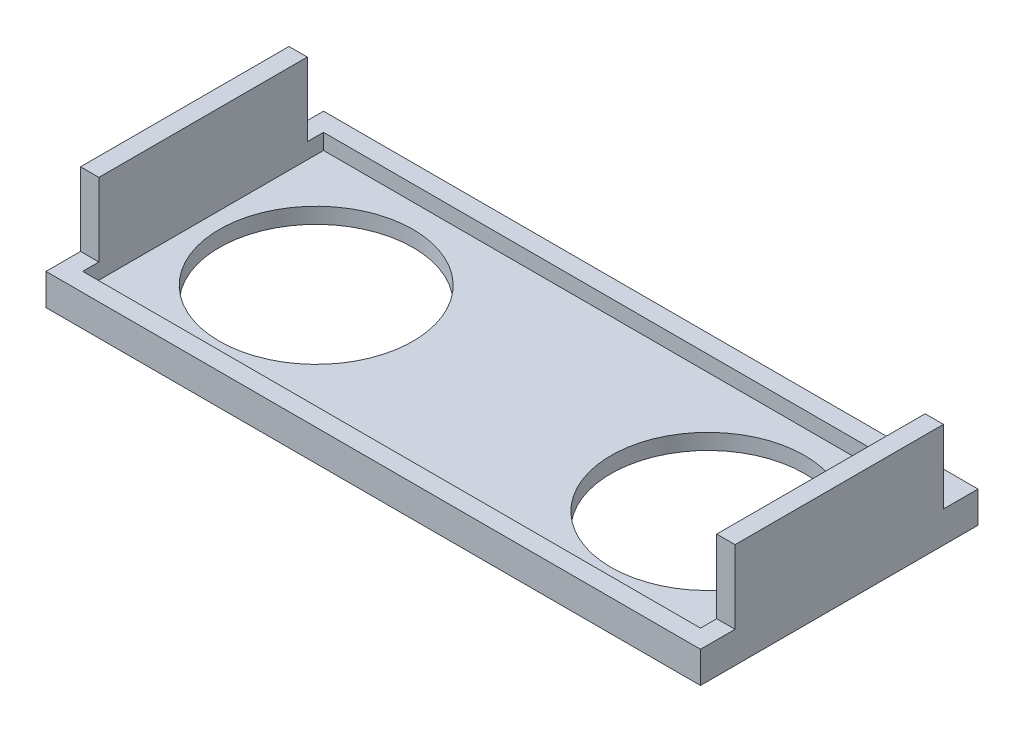
ISO-10303-21;
HEADER;
FILE_DESCRIPTION(('STEP AP214'),'2;1');
FILE_NAME('part.step','',(''),(''),'','','');
FILE_SCHEMA(('AUTOMOTIVE_DESIGN { 1 0 10303 214 1 1 1 1 }'));
ENDSEC;
DATA;
#1=APPLICATION_CONTEXT('core data for automotive mechanical design processes');
#2=APPLICATION_PROTOCOL_DEFINITION('international standard','automotive_design',2000,#1);
#3=PRODUCT_CONTEXT('',#1,'mechanical');
#4=PRODUCT('Part','Part','',(#3));
#5=PRODUCT_RELATED_PRODUCT_CATEGORY('part','',(#4));
#6=PRODUCT_DEFINITION_FORMATION('','',#4);
#7=PRODUCT_DEFINITION_CONTEXT('part definition',#1,'design');
#8=PRODUCT_DEFINITION('design','',#6,#7);
#9=PRODUCT_DEFINITION_SHAPE('','',#8);
#10=(LENGTH_UNIT() NAMED_UNIT(*) SI_UNIT(.MILLI.,.METRE.));
#11=(NAMED_UNIT(*) PLANE_ANGLE_UNIT() SI_UNIT($,.RADIAN.));
#12=(NAMED_UNIT(*) SI_UNIT($,.STERADIAN.) SOLID_ANGLE_UNIT());
#13=UNCERTAINTY_MEASURE_WITH_UNIT(LENGTH_MEASURE(1.E-05),#10,'distance_accuracy_value','');
#14=(GEOMETRIC_REPRESENTATION_CONTEXT(3) GLOBAL_UNCERTAINTY_ASSIGNED_CONTEXT((#13)) GLOBAL_UNIT_ASSIGNED_CONTEXT((#10,
#11,#12)) REPRESENTATION_CONTEXT('',''));
#15=CARTESIAN_POINT('',(0.,0.,0.));
#16=DIRECTION('',(0.,0.,1.));
#17=DIRECTION('',(1.,0.,0.));
#18=AXIS2_PLACEMENT_3D('',#15,#16,#17);
#19=CARTESIAN_POINT('',(0.,1.5,0.));
#20=DIRECTION('',(0.,1.,0.));
#21=DIRECTION('',(0.,0.,1.));
#22=AXIS2_PLACEMENT_3D('',#19,#20,#21);
#23=PLANE('',#22);
#24=DIRECTION('',(0.,0.,1.));
#25=VECTOR('',#24,1.);
#26=CARTESIAN_POINT('',(-31.25,1.5,-13.25));
#27=LINE('',#26,#25);
#28=CARTESIAN_POINT('',(-31.25,1.5,-13.25));
#29=VERTEX_POINT('',#28);
#30=CARTESIAN_POINT('',(-31.25,1.5,-9.95));
#31=VERTEX_POINT('',#30);
#32=EDGE_CURVE('E55',#29,#31,#27,.T.);
#33=ORIENTED_EDGE('',*,*,#32,.T.);
#34=DIRECTION('',(1.,0.,0.));
#35=VECTOR('',#34,1.);
#36=CARTESIAN_POINT('',(0.,1.5,-9.95));
#37=LINE('',#36,#35);
#38=CARTESIAN_POINT('',(-29.5,1.5,-9.95));
#39=VERTEX_POINT('',#38);
#40=EDGE_CURVE('E59',#31,#39,#37,.T.);
#41=ORIENTED_EDGE('',*,*,#40,.T.);
#42=DIRECTION('',(0.,0.,-1.));
#43=VECTOR('',#42,1.);
#44=CARTESIAN_POINT('',(-29.5,1.5,0.));
#45=LINE('',#44,#43);
#46=CARTESIAN_POINT('',(-29.5,1.5,-11.5));
#47=VERTEX_POINT('',#46);
#48=EDGE_CURVE('E158',#39,#47,#45,.T.);
#49=ORIENTED_EDGE('',*,*,#48,.T.);
#50=DIRECTION('',(1.,0.,0.));
#51=VECTOR('',#50,1.);
#52=CARTESIAN_POINT('',(0.,1.5,-11.5));
#53=LINE('',#52,#51);
#54=CARTESIAN_POINT('',(29.5,1.5,-11.5));
#55=VERTEX_POINT('',#54);
#56=EDGE_CURVE('E240',#47,#55,#53,.T.);
#57=ORIENTED_EDGE('',*,*,#56,.T.);
#58=DIRECTION('',(0.,0.,1.));
#59=VECTOR('',#58,1.);
#60=CARTESIAN_POINT('',(29.5,1.5,0.));
#61=LINE('',#60,#59);
#62=CARTESIAN_POINT('',(29.5,1.5,-9.95));
#63=VERTEX_POINT('',#62);
#64=EDGE_CURVE('E271',#55,#63,#61,.T.);
#65=ORIENTED_EDGE('',*,*,#64,.T.);
#66=DIRECTION('',(-1.,0.,0.));
#67=VECTOR('',#66,1.);
#68=CARTESIAN_POINT('',(0.,1.5,-9.95));
#69=LINE('',#68,#67);
#70=CARTESIAN_POINT('',(31.25,1.5,-9.95));
#71=VERTEX_POINT('',#70);
#72=EDGE_CURVE('E224',#71,#63,#69,.T.);
#73=ORIENTED_EDGE('',*,*,#72,.F.);
#74=DIRECTION('',(0.,0.,-1.));
#75=VECTOR('',#74,1.);
#76=CARTESIAN_POINT('',(31.25,1.5,-13.25));
#77=LINE('',#76,#75);
#78=CARTESIAN_POINT('',(31.25,1.5,-13.25));
#79=VERTEX_POINT('',#78);
#80=EDGE_CURVE('E298',#71,#79,#77,.T.);
#81=ORIENTED_EDGE('',*,*,#80,.T.);
#82=DIRECTION('',(-1.,0.,0.));
#83=VECTOR('',#82,1.);
#84=CARTESIAN_POINT('',(-31.25,1.5,-13.25));
#85=LINE('',#84,#83);
#86=EDGE_CURVE('E297',#79,#29,#85,.T.);
#87=ORIENTED_EDGE('',*,*,#86,.T.);
#88=EDGE_LOOP('',(#33,#41,#49,#57,#65,#73,#81,#87));
#89=FACE_BOUND('',#88,.T.);
#90=ADVANCED_FACE('F39',(#89),#23,.T.);
#91=CARTESIAN_POINT('',(-29.5,1.5,11.5));
#92=VERTEX_POINT('',#91);
#93=CARTESIAN_POINT('',(-29.5,1.5,9.95));
#94=VERTEX_POINT('',#93);
#95=EDGE_CURVE('E257',#92,#94,#45,.T.);
#96=ORIENTED_EDGE('',*,*,#95,.T.);
#97=DIRECTION('',(-1.,0.,0.));
#98=VECTOR('',#97,1.);
#99=CARTESIAN_POINT('',(0.,1.5,9.95));
#100=LINE('',#99,#98);
#101=CARTESIAN_POINT('',(-31.25,1.5,9.95));
#102=VERTEX_POINT('',#101);
#103=EDGE_CURVE('E171',#94,#102,#100,.T.);
#104=ORIENTED_EDGE('',*,*,#103,.T.);
#105=CARTESIAN_POINT('',(-31.25,1.5,13.25));
#106=VERTEX_POINT('',#105);
#107=EDGE_CURVE('E301',#102,#106,#27,.T.);
#108=ORIENTED_EDGE('',*,*,#107,.T.);
#109=DIRECTION('',(1.,0.,0.));
#110=VECTOR('',#109,1.);
#111=CARTESIAN_POINT('',(-31.25,1.5,13.25));
#112=LINE('',#111,#110);
#113=CARTESIAN_POINT('',(31.25,1.5,13.25));
#114=VERTEX_POINT('',#113);
#115=EDGE_CURVE('E304',#106,#114,#112,.T.);
#116=ORIENTED_EDGE('',*,*,#115,.T.);
#117=CARTESIAN_POINT('',(31.25,1.5,9.95));
#118=VERTEX_POINT('',#117);
#119=EDGE_CURVE('E294',#114,#118,#77,.T.);
#120=ORIENTED_EDGE('',*,*,#119,.T.);
#121=DIRECTION('',(1.,0.,0.));
#122=VECTOR('',#121,1.);
#123=CARTESIAN_POINT('',(0.,1.5,9.95));
#124=LINE('',#123,#122);
#125=CARTESIAN_POINT('',(29.5,1.5,9.95));
#126=VERTEX_POINT('',#125);
#127=EDGE_CURVE('E231',#126,#118,#124,.T.);
#128=ORIENTED_EDGE('',*,*,#127,.F.);
#129=CARTESIAN_POINT('',(29.5,1.5,11.5));
#130=VERTEX_POINT('',#129);
#131=EDGE_CURVE('E270',#126,#130,#61,.T.);
#132=ORIENTED_EDGE('',*,*,#131,.T.);
#133=DIRECTION('',(-1.,0.,0.));
#134=VECTOR('',#133,1.);
#135=CARTESIAN_POINT('',(0.,1.5,11.5));
#136=LINE('',#135,#134);
#137=EDGE_CURVE('E274',#130,#92,#136,.T.);
#138=ORIENTED_EDGE('',*,*,#137,.T.);
#139=EDGE_LOOP('',(#96,#104,#108,#116,#120,#128,#132,#138));
#140=FACE_BOUND('',#139,.T.);
#141=ADVANCED_FACE('F349',(#140),#23,.T.);
#142=CARTESIAN_POINT('',(31.25,1.5,-13.25));
#143=DIRECTION('',(-1.,0.,0.));
#144=DIRECTION('',(0.,0.,1.));
#145=AXIS2_PLACEMENT_3D('',#142,#143,#144);
#146=PLANE('',#145);
#147=ORIENTED_EDGE('',*,*,#80,.F.);
#148=DIRECTION('',(0.,1.,0.));
#149=VECTOR('',#148,1.);
#150=CARTESIAN_POINT('',(31.25,1.5,-9.95));
#151=LINE('',#150,#149);
#152=CARTESIAN_POINT('',(31.25,8.5,-9.95));
#153=VERTEX_POINT('',#152);
#154=EDGE_CURVE('E198',#71,#153,#151,.T.);
#155=ORIENTED_EDGE('',*,*,#154,.T.);
#156=DIRECTION('',(0.,0.,1.));
#157=VECTOR('',#156,1.);
#158=CARTESIAN_POINT('',(31.25,8.5,-13.25));
#159=LINE('',#158,#157);
#160=CARTESIAN_POINT('',(31.25,8.5,9.95));
#161=VERTEX_POINT('',#160);
#162=EDGE_CURVE('E214',#153,#161,#159,.T.);
#163=ORIENTED_EDGE('',*,*,#162,.T.);
#164=DIRECTION('',(0.,-1.,0.));
#165=VECTOR('',#164,1.);
#166=CARTESIAN_POINT('',(31.25,1.5,9.95));
#167=LINE('',#166,#165);
#168=EDGE_CURVE('E203',#161,#118,#167,.T.);
#169=ORIENTED_EDGE('',*,*,#168,.T.);
#170=ORIENTED_EDGE('',*,*,#119,.F.);
#171=DIRECTION('',(0.,-1.,0.));
#172=VECTOR('',#171,1.);
#173=CARTESIAN_POINT('',(31.25,1.5,13.25));
#174=LINE('',#173,#172);
#175=CARTESIAN_POINT('',(31.25,-1.5,13.25));
#176=VERTEX_POINT('',#175);
#177=EDGE_CURVE('E307',#114,#176,#174,.T.);
#178=ORIENTED_EDGE('',*,*,#177,.T.);
#179=DIRECTION('',(0.,0.,-1.));
#180=VECTOR('',#179,1.);
#181=CARTESIAN_POINT('',(31.25,-1.5,-13.25));
#182=LINE('',#181,#180);
#183=CARTESIAN_POINT('',(31.25,-1.5,-13.25));
#184=VERTEX_POINT('',#183);
#185=EDGE_CURVE('E293',#176,#184,#182,.T.);
#186=ORIENTED_EDGE('',*,*,#185,.T.);
#187=DIRECTION('',(0.,-1.,0.));
#188=VECTOR('',#187,1.);
#189=CARTESIAN_POINT('',(31.25,1.5,-13.25));
#190=LINE('',#189,#188);
#191=EDGE_CURVE('E11',#79,#184,#190,.T.);
#192=ORIENTED_EDGE('',*,*,#191,.F.);
#193=EDGE_LOOP('',(#147,#155,#163,#169,#170,#178,#186,#192));
#194=FACE_BOUND('',#193,.T.);
#195=ADVANCED_FACE('F41',(#194),#146,.F.);
#196=CARTESIAN_POINT('',(-31.25,1.5,-13.25));
#197=DIRECTION('',(0.,0.,1.));
#198=DIRECTION('',(1.,0.,0.));
#199=AXIS2_PLACEMENT_3D('',#196,#197,#198);
#200=PLANE('',#199);
#201=DIRECTION('',(-1.,0.,0.));
#202=VECTOR('',#201,1.);
#203=CARTESIAN_POINT('',(-31.25,-1.5,-13.25));
#204=LINE('',#203,#202);
#205=CARTESIAN_POINT('',(-31.25,-1.5,-13.25));
#206=VERTEX_POINT('',#205);
#207=EDGE_CURVE('E310',#184,#206,#204,.T.);
#208=ORIENTED_EDGE('',*,*,#207,.T.);
#209=DIRECTION('',(0.,-1.,0.));
#210=VECTOR('',#209,1.);
#211=CARTESIAN_POINT('',(-31.25,1.5,-13.25));
#212=LINE('',#211,#210);
#213=EDGE_CURVE('E48',#29,#206,#212,.T.);
#214=ORIENTED_EDGE('',*,*,#213,.F.);
#215=ORIENTED_EDGE('',*,*,#86,.F.);
#216=ORIENTED_EDGE('',*,*,#191,.T.);
#217=EDGE_LOOP('',(#208,#214,#215,#216));
#218=FACE_BOUND('',#217,.T.);
#219=ADVANCED_FACE('F388',(#218),#200,.F.);
#220=CARTESIAN_POINT('',(-31.25,1.5,-13.25));
#221=DIRECTION('',(1.,0.,0.));
#222=DIRECTION('',(0.,0.,-1.));
#223=AXIS2_PLACEMENT_3D('',#220,#221,#222);
#224=PLANE('',#223);
#225=ORIENTED_EDGE('',*,*,#107,.F.);
#226=DIRECTION('',(0.,-1.,0.));
#227=VECTOR('',#226,1.);
#228=CARTESIAN_POINT('',(-31.25,1.5,9.95));
#229=LINE('',#228,#227);
#230=CARTESIAN_POINT('',(-31.25,8.5,9.95));
#231=VERTEX_POINT('',#230);
#232=EDGE_CURVE('E161',#231,#102,#229,.T.);
#233=ORIENTED_EDGE('',*,*,#232,.F.);
#234=DIRECTION('',(0.,0.,1.));
#235=VECTOR('',#234,1.);
#236=CARTESIAN_POINT('',(-31.25,8.5,-13.25));
#237=LINE('',#236,#235);
#238=CARTESIAN_POINT('',(-31.25,8.5,-9.95));
#239=VERTEX_POINT('',#238);
#240=EDGE_CURVE('E185',#239,#231,#237,.T.);
#241=ORIENTED_EDGE('',*,*,#240,.F.);
#242=DIRECTION('',(0.,1.,0.));
#243=VECTOR('',#242,1.);
#244=CARTESIAN_POINT('',(-31.25,1.5,-9.95));
#245=LINE('',#244,#243);
#246=EDGE_CURVE('E167',#31,#239,#245,.T.);
#247=ORIENTED_EDGE('',*,*,#246,.F.);
#248=ORIENTED_EDGE('',*,*,#32,.F.);
#249=ORIENTED_EDGE('',*,*,#213,.T.);
#250=DIRECTION('',(0.,0.,1.));
#251=VECTOR('',#250,1.);
#252=CARTESIAN_POINT('',(-31.25,-1.5,-13.25));
#253=LINE('',#252,#251);
#254=CARTESIAN_POINT('',(-31.25,-1.5,13.25));
#255=VERTEX_POINT('',#254);
#256=EDGE_CURVE('E313',#206,#255,#253,.T.);
#257=ORIENTED_EDGE('',*,*,#256,.T.);
#258=DIRECTION('',(0.,-1.,0.));
#259=VECTOR('',#258,1.);
#260=CARTESIAN_POINT('',(-31.25,1.5,13.25));
#261=LINE('',#260,#259);
#262=EDGE_CURVE('E322',#106,#255,#261,.T.);
#263=ORIENTED_EDGE('',*,*,#262,.F.);
#264=EDGE_LOOP('',(#225,#233,#241,#247,#248,#249,#257,#263));
#265=FACE_BOUND('',#264,.T.);
#266=ADVANCED_FACE('F330',(#265),#224,.F.);
#267=CARTESIAN_POINT('',(-31.25,1.5,13.25));
#268=DIRECTION('',(0.,0.,-1.));
#269=DIRECTION('',(-1.,0.,0.));
#270=AXIS2_PLACEMENT_3D('',#267,#268,#269);
#271=PLANE('',#270);
#272=DIRECTION('',(1.,0.,0.));
#273=VECTOR('',#272,1.);
#274=CARTESIAN_POINT('',(-31.25,-1.5,13.25));
#275=LINE('',#274,#273);
#276=EDGE_CURVE('E316',#255,#176,#275,.T.);
#277=ORIENTED_EDGE('',*,*,#276,.T.);
#278=ORIENTED_EDGE('',*,*,#177,.F.);
#279=ORIENTED_EDGE('',*,*,#115,.F.);
#280=ORIENTED_EDGE('',*,*,#262,.T.);
#281=EDGE_LOOP('',(#277,#278,#279,#280));
#282=FACE_BOUND('',#281,.T.);
#283=ADVANCED_FACE('F342',(#282),#271,.F.);
#284=CARTESIAN_POINT('',(0.,-1.5,0.));
#285=DIRECTION('',(0.,1.,0.));
#286=DIRECTION('',(0.,0.,1.));
#287=AXIS2_PLACEMENT_3D('',#284,#285,#286);
#288=PLANE('',#287);
#289=ORIENTED_EDGE('',*,*,#276,.F.);
#290=ORIENTED_EDGE('',*,*,#256,.F.);
#291=ORIENTED_EDGE('',*,*,#207,.F.);
#292=ORIENTED_EDGE('',*,*,#185,.F.);
#293=EDGE_LOOP('',(#289,#290,#291,#292));
#294=FACE_BOUND('',#293,.T.);
#295=CARTESIAN_POINT('',(18.7,-1.5,0.));
#296=DIRECTION('',(0.,1.,0.));
#297=DIRECTION('',(0.,0.,-1.));
#298=AXIS2_PLACEMENT_3D('',#295,#296,#297);
#299=CIRCLE('',#298,9.25);
#300=CARTESIAN_POINT('',(18.7,-1.5,-9.25));
#301=VERTEX_POINT('',#300);
#302=EDGE_CURVE('E245',#301,#301,#299,.T.);
#303=ORIENTED_EDGE('',*,*,#302,.T.);
#304=EDGE_LOOP('',(#303));
#305=FACE_BOUND('',#304,.T.);
#306=CARTESIAN_POINT('',(-18.7,-1.5,0.));
#307=DIRECTION('',(0.,1.,0.));
#308=DIRECTION('',(0.,0.,1.));
#309=AXIS2_PLACEMENT_3D('',#306,#307,#308);
#310=CIRCLE('',#309,9.25);
#311=CARTESIAN_POINT('',(-18.7,-1.5,9.25));
#312=VERTEX_POINT('',#311);
#313=EDGE_CURVE('E236',#312,#312,#310,.T.);
#314=ORIENTED_EDGE('',*,*,#313,.T.);
#315=EDGE_LOOP('',(#314));
#316=FACE_BOUND('',#315,.T.);
#317=ADVANCED_FACE('F337',(#294,#305,#316),#288,.F.);
#318=CARTESIAN_POINT('',(0.,0.,-11.5));
#319=DIRECTION('',(0.,0.,1.));
#320=DIRECTION('',(1.,0.,0.));
#321=AXIS2_PLACEMENT_3D('',#318,#319,#320);
#322=PLANE('',#321);
#323=ORIENTED_EDGE('',*,*,#56,.F.);
#324=DIRECTION('',(0.,1.,0.));
#325=VECTOR('',#324,1.);
#326=CARTESIAN_POINT('',(-29.5,0.,-11.5));
#327=LINE('',#326,#325);
#328=CARTESIAN_POINT('',(-29.5,0.,-11.5));
#329=VERTEX_POINT('',#328);
#330=EDGE_CURVE('E266',#329,#47,#327,.T.);
#331=ORIENTED_EDGE('',*,*,#330,.F.);
#332=DIRECTION('',(1.,0.,0.));
#333=VECTOR('',#332,1.);
#334=CARTESIAN_POINT('',(0.,0.,-11.5));
#335=LINE('',#334,#333);
#336=CARTESIAN_POINT('',(29.5,0.,-11.5));
#337=VERTEX_POINT('',#336);
#338=EDGE_CURVE('E252',#329,#337,#335,.T.);
#339=ORIENTED_EDGE('',*,*,#338,.T.);
#340=DIRECTION('',(0.,1.,0.));
#341=VECTOR('',#340,1.);
#342=CARTESIAN_POINT('',(29.5,0.,-11.5));
#343=LINE('',#342,#341);
#344=EDGE_CURVE('E289',#337,#55,#343,.T.);
#345=ORIENTED_EDGE('',*,*,#344,.T.);
#346=EDGE_LOOP('',(#323,#331,#339,#345));
#347=FACE_BOUND('',#346,.T.);
#348=ADVANCED_FACE('F380',(#347),#322,.T.);
#349=CARTESIAN_POINT('',(29.5,0.,0.));
#350=DIRECTION('',(-1.,0.,0.));
#351=DIRECTION('',(0.,0.,1.));
#352=AXIS2_PLACEMENT_3D('',#349,#350,#351);
#353=PLANE('',#352);
#354=DIRECTION('',(0.,0.,1.));
#355=VECTOR('',#354,1.);
#356=CARTESIAN_POINT('',(29.5,0.,0.));
#357=LINE('',#356,#355);
#358=CARTESIAN_POINT('',(29.5,0.,11.5));
#359=VERTEX_POINT('',#358);
#360=EDGE_CURVE('E256',#337,#359,#357,.T.);
#361=ORIENTED_EDGE('',*,*,#360,.T.);
#362=DIRECTION('',(0.,1.,0.));
#363=VECTOR('',#362,1.);
#364=CARTESIAN_POINT('',(29.5,0.,11.5));
#365=LINE('',#364,#363);
#366=EDGE_CURVE('E285',#359,#130,#365,.T.);
#367=ORIENTED_EDGE('',*,*,#366,.T.);
#368=ORIENTED_EDGE('',*,*,#131,.F.);
#369=DIRECTION('',(0.,-1.,0.));
#370=VECTOR('',#369,1.);
#371=CARTESIAN_POINT('',(29.5,1.5,9.95));
#372=LINE('',#371,#370);
#373=CARTESIAN_POINT('',(29.5,8.5,9.95));
#374=VERTEX_POINT('',#373);
#375=EDGE_CURVE('E207',#374,#126,#372,.T.);
#376=ORIENTED_EDGE('',*,*,#375,.F.);
#377=DIRECTION('',(0.,0.,1.));
#378=VECTOR('',#377,1.);
#379=CARTESIAN_POINT('',(29.5,8.5,-13.25));
#380=LINE('',#379,#378);
#381=CARTESIAN_POINT('',(29.5,8.5,-9.95));
#382=VERTEX_POINT('',#381);
#383=EDGE_CURVE('E202',#382,#374,#380,.T.);
#384=ORIENTED_EDGE('',*,*,#383,.F.);
#385=DIRECTION('',(0.,1.,0.));
#386=VECTOR('',#385,1.);
#387=CARTESIAN_POINT('',(29.5,1.5,-9.95));
#388=LINE('',#387,#386);
#389=EDGE_CURVE('E199',#63,#382,#388,.T.);
#390=ORIENTED_EDGE('',*,*,#389,.F.);
#391=ORIENTED_EDGE('',*,*,#64,.F.);
#392=ORIENTED_EDGE('',*,*,#344,.F.);
#393=EDGE_LOOP('',(#361,#367,#368,#376,#384,#390,#391,#392));
#394=FACE_BOUND('',#393,.T.);
#395=ADVANCED_FACE('F356',(#394),#353,.T.);
#396=CARTESIAN_POINT('',(0.,0.,11.5));
#397=DIRECTION('',(0.,0.,-1.));
#398=DIRECTION('',(-1.,0.,0.));
#399=AXIS2_PLACEMENT_3D('',#396,#397,#398);
#400=PLANE('',#399);
#401=ORIENTED_EDGE('',*,*,#137,.F.);
#402=ORIENTED_EDGE('',*,*,#366,.F.);
#403=DIRECTION('',(-1.,0.,0.));
#404=VECTOR('',#403,1.);
#405=CARTESIAN_POINT('',(0.,0.,11.5));
#406=LINE('',#405,#404);
#407=CARTESIAN_POINT('',(-29.5,0.,11.5));
#408=VERTEX_POINT('',#407);
#409=EDGE_CURVE('E260',#359,#408,#406,.T.);
#410=ORIENTED_EDGE('',*,*,#409,.T.);
#411=DIRECTION('',(0.,1.,0.));
#412=VECTOR('',#411,1.);
#413=CARTESIAN_POINT('',(-29.5,0.,11.5));
#414=LINE('',#413,#412);
#415=EDGE_CURVE('E282',#408,#92,#414,.T.);
#416=ORIENTED_EDGE('',*,*,#415,.T.);
#417=EDGE_LOOP('',(#401,#402,#410,#416));
#418=FACE_BOUND('',#417,.T.);
#419=ADVANCED_FACE('F372',(#418),#400,.T.);
#420=CARTESIAN_POINT('',(-29.5,0.,0.));
#421=DIRECTION('',(1.,0.,0.));
#422=DIRECTION('',(0.,0.,-1.));
#423=AXIS2_PLACEMENT_3D('',#420,#421,#422);
#424=PLANE('',#423);
#425=DIRECTION('',(0.,0.,-1.));
#426=VECTOR('',#425,1.);
#427=CARTESIAN_POINT('',(-29.5,0.,0.));
#428=LINE('',#427,#426);
#429=EDGE_CURVE('E263',#408,#329,#428,.T.);
#430=ORIENTED_EDGE('',*,*,#429,.T.);
#431=ORIENTED_EDGE('',*,*,#330,.T.);
#432=ORIENTED_EDGE('',*,*,#48,.F.);
#433=DIRECTION('',(0.,1.,0.));
#434=VECTOR('',#433,1.);
#435=CARTESIAN_POINT('',(-29.5,1.5,-9.95));
#436=LINE('',#435,#434);
#437=CARTESIAN_POINT('',(-29.5,8.5,-9.95));
#438=VERTEX_POINT('',#437);
#439=EDGE_CURVE('E150',#39,#438,#436,.T.);
#440=ORIENTED_EDGE('',*,*,#439,.T.);
#441=DIRECTION('',(0.,0.,1.));
#442=VECTOR('',#441,1.);
#443=CARTESIAN_POINT('',(-29.5,8.5,-13.25));
#444=LINE('',#443,#442);
#445=CARTESIAN_POINT('',(-29.5,8.5,9.95));
#446=VERTEX_POINT('',#445);
#447=EDGE_CURVE('E155',#438,#446,#444,.T.);
#448=ORIENTED_EDGE('',*,*,#447,.T.);
#449=DIRECTION('',(0.,-1.,0.));
#450=VECTOR('',#449,1.);
#451=CARTESIAN_POINT('',(-29.5,1.5,9.95));
#452=LINE('',#451,#450);
#453=EDGE_CURVE('E178',#446,#94,#452,.T.);
#454=ORIENTED_EDGE('',*,*,#453,.T.);
#455=ORIENTED_EDGE('',*,*,#95,.F.);
#456=ORIENTED_EDGE('',*,*,#415,.F.);
#457=EDGE_LOOP('',(#430,#431,#432,#440,#448,#454,#455,#456));
#458=FACE_BOUND('',#457,.T.);
#459=ADVANCED_FACE('F152',(#458),#424,.T.);
#460=CARTESIAN_POINT('',(0.,0.,0.));
#461=DIRECTION('',(0.,-1.,0.));
#462=DIRECTION('',(0.,0.,-1.));
#463=AXIS2_PLACEMENT_3D('',#460,#461,#462);
#464=PLANE('',#463);
#465=CARTESIAN_POINT('',(-18.7,0.,0.));
#466=DIRECTION('',(0.,1.,0.));
#467=DIRECTION('',(0.,0.,1.));
#468=AXIS2_PLACEMENT_3D('',#465,#466,#467);
#469=CIRCLE('',#468,9.25);
#470=CARTESIAN_POINT('',(-18.7,0.,9.25));
#471=VERTEX_POINT('',#470);
#472=EDGE_CURVE('E241',#471,#471,#469,.T.);
#473=ORIENTED_EDGE('',*,*,#472,.F.);
#474=EDGE_LOOP('',(#473));
#475=FACE_BOUND('',#474,.T.);
#476=CARTESIAN_POINT('',(18.7,0.,0.));
#477=DIRECTION('',(0.,1.,0.));
#478=DIRECTION('',(0.,0.,-1.));
#479=AXIS2_PLACEMENT_3D('',#476,#477,#478);
#480=CIRCLE('',#479,9.25);
#481=CARTESIAN_POINT('',(18.7,0.,-9.25));
#482=VERTEX_POINT('',#481);
#483=EDGE_CURVE('E235',#482,#482,#480,.T.);
#484=ORIENTED_EDGE('',*,*,#483,.F.);
#485=EDGE_LOOP('',(#484));
#486=FACE_BOUND('',#485,.T.);
#487=ORIENTED_EDGE('',*,*,#338,.F.);
#488=ORIENTED_EDGE('',*,*,#429,.F.);
#489=ORIENTED_EDGE('',*,*,#409,.F.);
#490=ORIENTED_EDGE('',*,*,#360,.F.);
#491=EDGE_LOOP('',(#487,#488,#489,#490));
#492=FACE_BOUND('',#491,.T.);
#493=ADVANCED_FACE('F376',(#475,#486,#492),#464,.F.);
#494=CARTESIAN_POINT('',(18.7,-1.5,0.));
#495=DIRECTION('',(0.,1.,0.));
#496=DIRECTION('',(0.,0.,1.));
#497=AXIS2_PLACEMENT_3D('',#494,#495,#496);
#498=CYLINDRICAL_SURFACE('',#497,9.25);
#499=ORIENTED_EDGE('',*,*,#302,.F.);
#500=EDGE_LOOP('',(#499));
#501=FACE_BOUND('',#500,.T.);
#502=ORIENTED_EDGE('',*,*,#483,.T.);
#503=EDGE_LOOP('',(#502));
#504=FACE_BOUND('',#503,.T.);
#505=ADVANCED_FACE('F445',(#501,#504),#498,.F.);
#506=CARTESIAN_POINT('',(-18.7,-1.5,0.));
#507=DIRECTION('',(0.,1.,0.));
#508=DIRECTION('',(0.,0.,1.));
#509=AXIS2_PLACEMENT_3D('',#506,#507,#508);
#510=CYLINDRICAL_SURFACE('',#509,9.25);
#511=ORIENTED_EDGE('',*,*,#313,.F.);
#512=EDGE_LOOP('',(#511));
#513=FACE_BOUND('',#512,.T.);
#514=ORIENTED_EDGE('',*,*,#472,.T.);
#515=EDGE_LOOP('',(#514));
#516=FACE_BOUND('',#515,.T.);
#517=ADVANCED_FACE('F453',(#513,#516),#510,.F.);
#518=CARTESIAN_POINT('',(29.5,1.5,9.95));
#519=DIRECTION('',(0.,0.,1.));
#520=DIRECTION('',(1.,0.,0.));
#521=AXIS2_PLACEMENT_3D('',#518,#519,#520);
#522=PLANE('',#521);
#523=ORIENTED_EDGE('',*,*,#375,.T.);
#524=ORIENTED_EDGE('',*,*,#127,.T.);
#525=ORIENTED_EDGE('',*,*,#168,.F.);
#526=DIRECTION('',(1.,0.,0.));
#527=VECTOR('',#526,1.);
#528=CARTESIAN_POINT('',(29.5,8.5,9.95));
#529=LINE('',#528,#527);
#530=EDGE_CURVE('E221',#374,#161,#529,.T.);
#531=ORIENTED_EDGE('',*,*,#530,.F.);
#532=EDGE_LOOP('',(#523,#524,#525,#531));
#533=FACE_BOUND('',#532,.T.);
#534=ADVANCED_FACE('F352',(#533),#522,.T.);
#535=CARTESIAN_POINT('',(29.5,8.5,-13.25));
#536=DIRECTION('',(0.,1.,0.));
#537=DIRECTION('',(0.,0.,1.));
#538=AXIS2_PLACEMENT_3D('',#535,#536,#537);
#539=PLANE('',#538);
#540=ORIENTED_EDGE('',*,*,#162,.F.);
#541=DIRECTION('',(1.,0.,0.));
#542=VECTOR('',#541,1.);
#543=CARTESIAN_POINT('',(29.5,8.5,-9.95));
#544=LINE('',#543,#542);
#545=EDGE_CURVE('E211',#382,#153,#544,.T.);
#546=ORIENTED_EDGE('',*,*,#545,.F.);
#547=ORIENTED_EDGE('',*,*,#383,.T.);
#548=ORIENTED_EDGE('',*,*,#530,.T.);
#549=EDGE_LOOP('',(#540,#546,#547,#548));
#550=FACE_BOUND('',#549,.T.);
#551=ADVANCED_FACE('F467',(#550),#539,.T.);
#552=CARTESIAN_POINT('',(29.5,1.5,-9.95));
#553=DIRECTION('',(0.,0.,-1.));
#554=DIRECTION('',(0.,1.,0.));
#555=AXIS2_PLACEMENT_3D('',#552,#553,#554);
#556=PLANE('',#555);
#557=ORIENTED_EDGE('',*,*,#154,.F.);
#558=ORIENTED_EDGE('',*,*,#72,.T.);
#559=ORIENTED_EDGE('',*,*,#389,.T.);
#560=ORIENTED_EDGE('',*,*,#545,.T.);
#561=EDGE_LOOP('',(#557,#558,#559,#560));
#562=FACE_BOUND('',#561,.T.);
#563=ADVANCED_FACE('F385',(#562),#556,.T.);
#564=CARTESIAN_POINT('',(-29.5,1.5,-9.95));
#565=DIRECTION('',(0.,0.,1.));
#566=DIRECTION('',(0.,-1.,0.));
#567=AXIS2_PLACEMENT_3D('',#564,#565,#566);
#568=PLANE('',#567);
#569=ORIENTED_EDGE('',*,*,#40,.F.);
#570=ORIENTED_EDGE('',*,*,#246,.T.);
#571=DIRECTION('',(-1.,0.,0.));
#572=VECTOR('',#571,1.);
#573=CARTESIAN_POINT('',(-29.5,8.5,-9.95));
#574=LINE('',#573,#572);
#575=EDGE_CURVE('E164',#438,#239,#574,.T.);
#576=ORIENTED_EDGE('',*,*,#575,.F.);
#577=ORIENTED_EDGE('',*,*,#439,.F.);
#578=EDGE_LOOP('',(#569,#570,#576,#577));
#579=FACE_BOUND('',#578,.T.);
#580=ADVANCED_FACE('F165',(#579),#568,.F.);
#581=CARTESIAN_POINT('',(-29.5,8.5,-13.25));
#582=DIRECTION('',(0.,-1.,0.));
#583=DIRECTION('',(0.,0.,-1.));
#584=AXIS2_PLACEMENT_3D('',#581,#582,#583);
#585=PLANE('',#584);
#586=ORIENTED_EDGE('',*,*,#240,.T.);
#587=DIRECTION('',(-1.,0.,0.));
#588=VECTOR('',#587,1.);
#589=CARTESIAN_POINT('',(-29.5,8.5,9.95));
#590=LINE('',#589,#588);
#591=EDGE_CURVE('E172',#446,#231,#590,.T.);
#592=ORIENTED_EDGE('',*,*,#591,.F.);
#593=ORIENTED_EDGE('',*,*,#447,.F.);
#594=ORIENTED_EDGE('',*,*,#575,.T.);
#595=EDGE_LOOP('',(#586,#592,#593,#594));
#596=FACE_BOUND('',#595,.T.);
#597=ADVANCED_FACE('F174',(#596),#585,.F.);
#598=CARTESIAN_POINT('',(-29.5,1.5,9.95));
#599=DIRECTION('',(0.,0.,-1.));
#600=DIRECTION('',(-1.,0.,0.));
#601=AXIS2_PLACEMENT_3D('',#598,#599,#600);
#602=PLANE('',#601);
#603=ORIENTED_EDGE('',*,*,#103,.F.);
#604=ORIENTED_EDGE('',*,*,#453,.F.);
#605=ORIENTED_EDGE('',*,*,#591,.T.);
#606=ORIENTED_EDGE('',*,*,#232,.T.);
#607=EDGE_LOOP('',(#603,#604,#605,#606));
#608=FACE_BOUND('',#607,.T.);
#609=ADVANCED_FACE('F367',(#608),#602,.F.);
#610=CLOSED_SHELL('',(#90,#141,#195,#219,#266,#283,#317,#348,#395,#419,#459,#493,#505,#517,#534,
#551,#563,#580,#597,#609));
#611=MANIFOLD_SOLID_BREP('B2',#610);
#612=ADVANCED_BREP_SHAPE_REPRESENTATION('',(#18,#611),#14);
#613=SHAPE_DEFINITION_REPRESENTATION(#9,#612);
ENDSEC;
END-ISO-10303-21;
